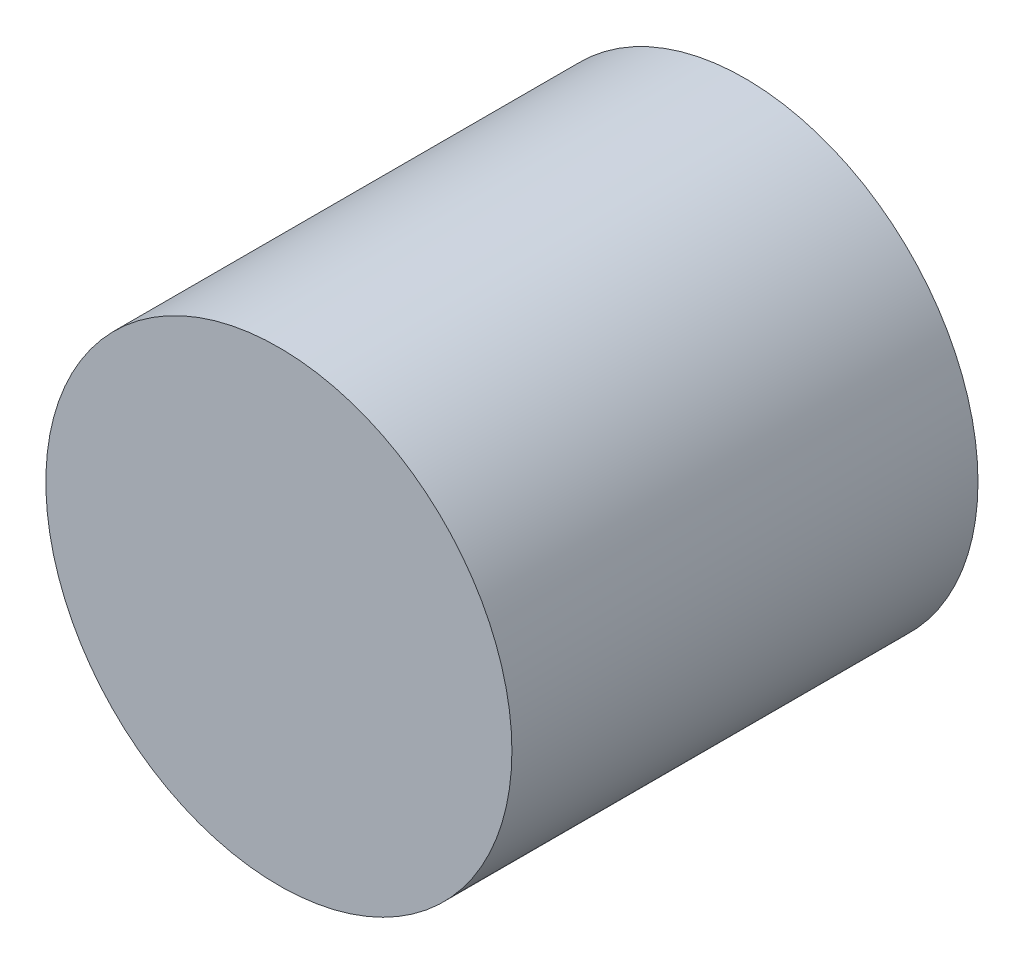
ISO-10303-21;
HEADER;
FILE_DESCRIPTION(('STEP AP214'),'2;1');
FILE_NAME('part.step','',(''),(''),'','','');
FILE_SCHEMA(('AUTOMOTIVE_DESIGN { 1 0 10303 214 1 1 1 1 }'));
ENDSEC;
DATA;
#1=APPLICATION_CONTEXT('core data for automotive mechanical design processes');
#2=APPLICATION_PROTOCOL_DEFINITION('international standard','automotive_design',2000,#1);
#3=PRODUCT_CONTEXT('',#1,'mechanical');
#4=PRODUCT('Part','Part','',(#3));
#5=PRODUCT_RELATED_PRODUCT_CATEGORY('part','',(#4));
#6=PRODUCT_DEFINITION_FORMATION('','',#4);
#7=PRODUCT_DEFINITION_CONTEXT('part definition',#1,'design');
#8=PRODUCT_DEFINITION('design','',#6,#7);
#9=PRODUCT_DEFINITION_SHAPE('','',#8);
#10=(LENGTH_UNIT() NAMED_UNIT(*) SI_UNIT(.MILLI.,.METRE.));
#11=(NAMED_UNIT(*) PLANE_ANGLE_UNIT() SI_UNIT($,.RADIAN.));
#12=(NAMED_UNIT(*) SI_UNIT($,.STERADIAN.) SOLID_ANGLE_UNIT());
#13=UNCERTAINTY_MEASURE_WITH_UNIT(LENGTH_MEASURE(1.E-05),#10,'distance_accuracy_value','');
#14=(GEOMETRIC_REPRESENTATION_CONTEXT(3) GLOBAL_UNCERTAINTY_ASSIGNED_CONTEXT((#13)) GLOBAL_UNIT_ASSIGNED_CONTEXT((#10,
#11,#12)) REPRESENTATION_CONTEXT('',''));
#15=CARTESIAN_POINT('',(0.,0.,0.));
#16=DIRECTION('',(0.,0.,1.));
#17=DIRECTION('',(1.,0.,0.));
#18=AXIS2_PLACEMENT_3D('',#15,#16,#17);
#19=CARTESIAN_POINT('',(0.,0.,4.));
#20=DIRECTION('',(0.,0.,-1.));
#21=DIRECTION('',(-1.,0.,0.));
#22=AXIS2_PLACEMENT_3D('',#19,#20,#21);
#23=CYLINDRICAL_SURFACE('',#22,2.);
#24=CARTESIAN_POINT('',(0.,0.,4.));
#25=DIRECTION('',(0.,0.,1.));
#26=DIRECTION('',(1.,0.,0.));
#27=AXIS2_PLACEMENT_3D('',#24,#25,#26);
#28=CIRCLE('',#27,2.);
#29=CARTESIAN_POINT('',(2.,0.,4.));
#30=VERTEX_POINT('',#29);
#31=EDGE_CURVE('E10',#30,#30,#28,.T.);
#32=ORIENTED_EDGE('',*,*,#31,.F.);
#33=EDGE_LOOP('',(#32));
#34=FACE_BOUND('',#33,.T.);
#35=CARTESIAN_POINT('',(0.,0.,0.));
#36=DIRECTION('',(0.,0.,1.));
#37=DIRECTION('',(1.,0.,0.));
#38=AXIS2_PLACEMENT_3D('',#35,#36,#37);
#39=CIRCLE('',#38,2.);
#40=CARTESIAN_POINT('',(2.,0.,0.));
#41=VERTEX_POINT('',#40);
#42=EDGE_CURVE('E34',#41,#41,#39,.T.);
#43=ORIENTED_EDGE('',*,*,#42,.T.);
#44=EDGE_LOOP('',(#43));
#45=FACE_BOUND('',#44,.T.);
#46=ADVANCED_FACE('F31',(#34,#45),#23,.T.);
#47=CARTESIAN_POINT('',(0.,0.,4.));
#48=DIRECTION('',(0.,0.,1.));
#49=DIRECTION('',(1.,0.,0.));
#50=AXIS2_PLACEMENT_3D('',#47,#48,#49);
#51=PLANE('',#50);
#52=ORIENTED_EDGE('',*,*,#31,.T.);
#53=EDGE_LOOP('',(#52));
#54=FACE_BOUND('',#53,.T.);
#55=ADVANCED_FACE('F46',(#54),#51,.T.);
#56=CARTESIAN_POINT('',(0.,0.,0.));
#57=DIRECTION('',(0.,0.,1.));
#58=DIRECTION('',(1.,0.,0.));
#59=AXIS2_PLACEMENT_3D('',#56,#57,#58);
#60=PLANE('',#59);
#61=ORIENTED_EDGE('',*,*,#42,.F.);
#62=EDGE_LOOP('',(#61));
#63=FACE_BOUND('',#62,.T.);
#64=ADVANCED_FACE('F44',(#63),#60,.F.);
#65=CLOSED_SHELL('',(#46,#55,#64));
#66=MANIFOLD_SOLID_BREP('B2',#65);
#67=ADVANCED_BREP_SHAPE_REPRESENTATION('',(#18,#66),#14);
#68=SHAPE_DEFINITION_REPRESENTATION(#9,#67);
ENDSEC;
END-ISO-10303-21;
